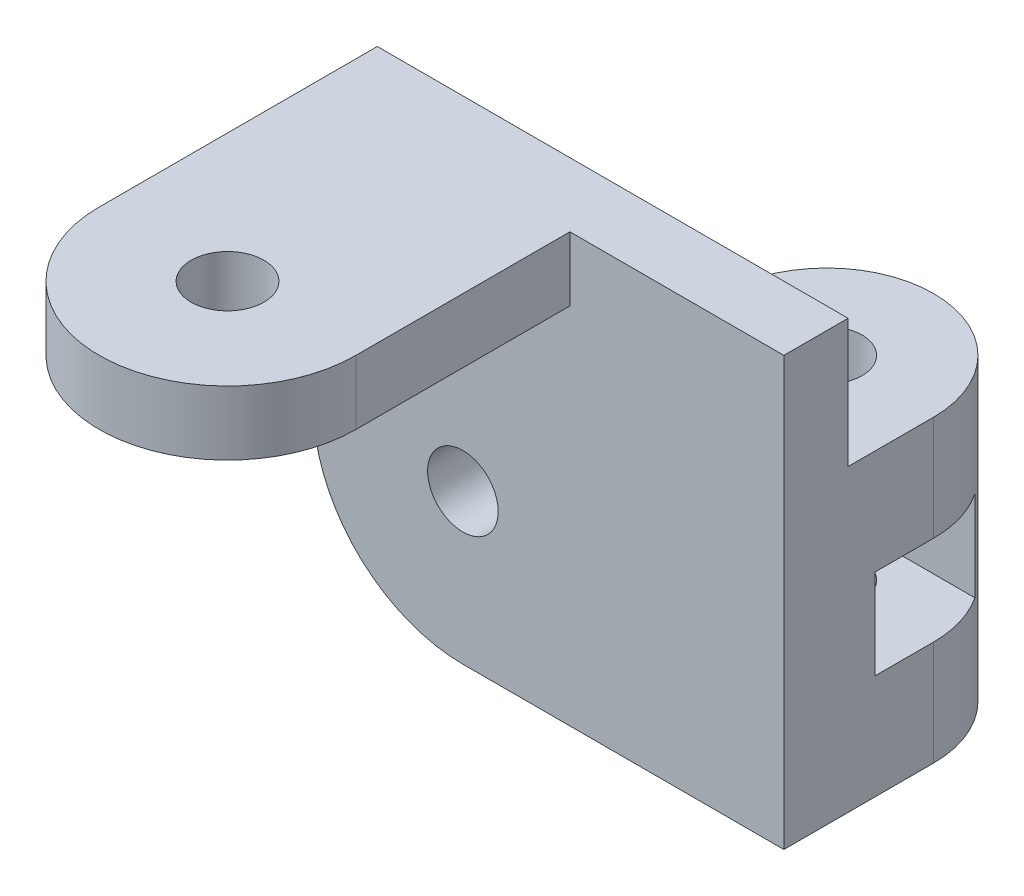
ISO-10303-21;
HEADER;
FILE_DESCRIPTION(('STEP AP214'),'2;1');
FILE_NAME('part.step','',(''),(''),'','','');
FILE_SCHEMA(('AUTOMOTIVE_DESIGN { 1 0 10303 214 1 1 1 1 }'));
ENDSEC;
DATA;
#1=APPLICATION_CONTEXT('core data for automotive mechanical design processes');
#2=APPLICATION_PROTOCOL_DEFINITION('international standard','automotive_design',2000,#1);
#3=PRODUCT_CONTEXT('',#1,'mechanical');
#4=PRODUCT('Part','Part','',(#3));
#5=PRODUCT_RELATED_PRODUCT_CATEGORY('part','',(#4));
#6=PRODUCT_DEFINITION_FORMATION('','',#4);
#7=PRODUCT_DEFINITION_CONTEXT('part definition',#1,'design');
#8=PRODUCT_DEFINITION('design','',#6,#7);
#9=PRODUCT_DEFINITION_SHAPE('','',#8);
#10=(LENGTH_UNIT() NAMED_UNIT(*) SI_UNIT(.MILLI.,.METRE.));
#11=(NAMED_UNIT(*) PLANE_ANGLE_UNIT() SI_UNIT($,.RADIAN.));
#12=(NAMED_UNIT(*) SI_UNIT($,.STERADIAN.) SOLID_ANGLE_UNIT());
#13=UNCERTAINTY_MEASURE_WITH_UNIT(LENGTH_MEASURE(1.E-05),#10,'distance_accuracy_value','');
#14=(GEOMETRIC_REPRESENTATION_CONTEXT(3) GLOBAL_UNCERTAINTY_ASSIGNED_CONTEXT((#13)) GLOBAL_UNIT_ASSIGNED_CONTEXT((#10,
#11,#12)) REPRESENTATION_CONTEXT('',''));
#15=CARTESIAN_POINT('',(0.,0.,0.));
#16=DIRECTION('',(0.,0.,1.));
#17=DIRECTION('',(1.,0.,0.));
#18=AXIS2_PLACEMENT_3D('',#15,#16,#17);
#19=CARTESIAN_POINT('',(7.5,7.,-4.));
#20=DIRECTION('',(0.,-1.,0.));
#21=DIRECTION('',(1.,0.,0.));
#22=AXIS2_PLACEMENT_3D('',#19,#20,#21);
#23=CYLINDRICAL_SURFACE('',#22,1.65);
#24=CARTESIAN_POINT('',(7.5,-2.1,-4.));
#25=DIRECTION('',(0.,-1.,0.));
#26=DIRECTION('',(0.,0.,-1.));
#27=AXIS2_PLACEMENT_3D('',#24,#25,#26);
#28=CIRCLE('',#27,1.65);
#29=CARTESIAN_POINT('',(7.5,-2.1,-5.65000000000001));
#30=VERTEX_POINT('',#29);
#31=EDGE_CURVE('E221',#30,#30,#28,.T.);
#32=ORIENTED_EDGE('',*,*,#31,.F.);
#33=EDGE_LOOP('',(#32));
#34=FACE_BOUND('',#33,.T.);
#35=CARTESIAN_POINT('',(7.5,-7.,-4.));
#36=DIRECTION('',(0.,1.,0.));
#37=DIRECTION('',(-1.,0.,0.));
#38=AXIS2_PLACEMENT_3D('',#35,#36,#37);
#39=CIRCLE('',#38,1.65);
#40=CARTESIAN_POINT('',(5.85,-7.,-4.));
#41=VERTEX_POINT('',#40);
#42=EDGE_CURVE('E226',#41,#41,#39,.T.);
#43=ORIENTED_EDGE('',*,*,#42,.F.);
#44=EDGE_LOOP('',(#43));
#45=FACE_BOUND('',#44,.T.);
#46=ADVANCED_FACE('F32',(#34,#45),#23,.F.);
#47=CARTESIAN_POINT('',(-2.5,0.,0.));
#48=DIRECTION('',(0.,0.,1.));
#49=DIRECTION('',(1.,0.,0.));
#50=AXIS2_PLACEMENT_3D('',#47,#48,#49);
#51=PLANE('',#50);
#52=DIRECTION('',(0.,-1.,0.));
#53=VECTOR('',#52,1.);
#54=CARTESIAN_POINT('',(-9.5,0.,0.));
#55=LINE('',#54,#53);
#56=CARTESIAN_POINT('',(-9.5,13.,0.));
#57=VERTEX_POINT('',#56);
#58=CARTESIAN_POINT('',(-9.5,0.,0.));
#59=VERTEX_POINT('',#58);
#60=EDGE_CURVE('E264',#57,#59,#55,.T.);
#61=ORIENTED_EDGE('',*,*,#60,.F.);
#62=DIRECTION('',(-1.,0.,0.));
#63=VECTOR('',#62,1.);
#64=CARTESIAN_POINT('',(-9.5,13.,0.));
#65=LINE('',#64,#63);
#66=CARTESIAN_POINT('',(12.5,13.,0.));
#67=VERTEX_POINT('',#66);
#68=EDGE_CURVE('E278',#67,#57,#65,.T.);
#69=ORIENTED_EDGE('',*,*,#68,.F.);
#70=DIRECTION('',(0.,1.,0.));
#71=VECTOR('',#70,1.);
#72=CARTESIAN_POINT('',(12.5,13.,0.));
#73=LINE('',#72,#71);
#74=CARTESIAN_POINT('',(12.5,7.,0.));
#75=VERTEX_POINT('',#74);
#76=EDGE_CURVE('E276',#75,#67,#73,.T.);
#77=ORIENTED_EDGE('',*,*,#76,.F.);
#78=DIRECTION('',(1.,0.,0.));
#79=VECTOR('',#78,1.);
#80=CARTESIAN_POINT('',(2.5,7.,0.));
#81=LINE('',#80,#79);
#82=CARTESIAN_POINT('',(2.5,7.,0.));
#83=VERTEX_POINT('',#82);
#84=EDGE_CURVE('E235',#83,#75,#81,.T.);
#85=ORIENTED_EDGE('',*,*,#84,.F.);
#86=DIRECTION('',(0.,-1.,0.));
#87=VECTOR('',#86,1.);
#88=CARTESIAN_POINT('',(2.5,7.,0.));
#89=LINE('',#88,#87);
#90=CARTESIAN_POINT('',(2.5,-7.,0.));
#91=VERTEX_POINT('',#90);
#92=EDGE_CURVE('E246',#83,#91,#89,.T.);
#93=ORIENTED_EDGE('',*,*,#92,.T.);
#94=DIRECTION('',(1.,0.,0.));
#95=VECTOR('',#94,1.);
#96=CARTESIAN_POINT('',(12.5,-7.,0.));
#97=LINE('',#96,#95);
#98=CARTESIAN_POINT('',(-2.5,-7.,0.));
#99=VERTEX_POINT('',#98);
#100=EDGE_CURVE('E273',#99,#91,#97,.T.);
#101=ORIENTED_EDGE('',*,*,#100,.F.);
#102=CARTESIAN_POINT('',(-2.5,0.,0.));
#103=DIRECTION('',(0.,0.,1.));
#104=DIRECTION('',(1.,0.,0.));
#105=AXIS2_PLACEMENT_3D('',#102,#103,#104);
#106=CIRCLE('',#105,7.);
#107=EDGE_CURVE('E257',#59,#99,#106,.T.);
#108=ORIENTED_EDGE('',*,*,#107,.F.);
#109=EDGE_LOOP('',(#61,#69,#77,#85,#93,#101,#108));
#110=FACE_BOUND('',#109,.T.);
#111=CARTESIAN_POINT('',(-2.5,0.,0.));
#112=DIRECTION('',(0.,0.,1.));
#113=DIRECTION('',(1.,0.,0.));
#114=AXIS2_PLACEMENT_3D('',#111,#112,#113);
#115=CIRCLE('',#114,1.65);
#116=CARTESIAN_POINT('',(-0.849999999999999,0.,0.));
#117=VERTEX_POINT('',#116);
#118=EDGE_CURVE('E253',#117,#117,#115,.T.);
#119=ORIENTED_EDGE('',*,*,#118,.T.);
#120=EDGE_LOOP('',(#119));
#121=FACE_BOUND('',#120,.T.);
#122=ADVANCED_FACE('F344',(#110,#121),#51,.F.);
#123=CARTESIAN_POINT('',(-2.5,0.,3.));
#124=DIRECTION('',(0.,0.,1.));
#125=DIRECTION('',(1.,0.,0.));
#126=AXIS2_PLACEMENT_3D('',#123,#124,#125);
#127=PLANE('',#126);
#128=DIRECTION('',(0.,1.,0.));
#129=VECTOR('',#128,1.);
#130=CARTESIAN_POINT('',(2.5,0.,3.));
#131=LINE('',#130,#129);
#132=CARTESIAN_POINT('',(2.5,10.,3.));
#133=VERTEX_POINT('',#132);
#134=CARTESIAN_POINT('',(2.5,13.,3.));
#135=VERTEX_POINT('',#134);
#136=EDGE_CURVE('E47',#133,#135,#131,.T.);
#137=ORIENTED_EDGE('',*,*,#136,.F.);
#138=DIRECTION('',(1.,0.,0.));
#139=VECTOR('',#138,1.);
#140=CARTESIAN_POINT('',(-2.5,10.,3.));
#141=LINE('',#140,#139);
#142=CARTESIAN_POINT('',(-9.5,9.99999999999999,3.));
#143=VERTEX_POINT('',#142);
#144=EDGE_CURVE('E182',#143,#133,#141,.T.);
#145=ORIENTED_EDGE('',*,*,#144,.F.);
#146=DIRECTION('',(0.,-1.,0.));
#147=VECTOR('',#146,1.);
#148=CARTESIAN_POINT('',(-9.5,0.,3.));
#149=LINE('',#148,#147);
#150=CARTESIAN_POINT('',(-9.5,0.,3.));
#151=VERTEX_POINT('',#150);
#152=EDGE_CURVE('E157',#143,#151,#149,.T.);
#153=ORIENTED_EDGE('',*,*,#152,.T.);
#154=CARTESIAN_POINT('',(-2.5,0.,3.));
#155=DIRECTION('',(0.,0.,1.));
#156=DIRECTION('',(1.,0.,0.));
#157=AXIS2_PLACEMENT_3D('',#154,#155,#156);
#158=CIRCLE('',#157,7.);
#159=CARTESIAN_POINT('',(-2.5,-7.,3.));
#160=VERTEX_POINT('',#159);
#161=EDGE_CURVE('E260',#151,#160,#158,.T.);
#162=ORIENTED_EDGE('',*,*,#161,.T.);
#163=DIRECTION('',(1.,0.,0.));
#164=VECTOR('',#163,1.);
#165=CARTESIAN_POINT('',(-2.5,-7.,3.));
#166=LINE('',#165,#164);
#167=CARTESIAN_POINT('',(12.5,-7.,3.));
#168=VERTEX_POINT('',#167);
#169=EDGE_CURVE('E263',#160,#168,#166,.T.);
#170=ORIENTED_EDGE('',*,*,#169,.T.);
#171=DIRECTION('',(0.,1.,0.));
#172=VECTOR('',#171,1.);
#173=CARTESIAN_POINT('',(12.5,13.,3.));
#174=LINE('',#173,#172);
#175=CARTESIAN_POINT('',(12.5,13.,3.));
#176=VERTEX_POINT('',#175);
#177=EDGE_CURVE('E266',#168,#176,#174,.T.);
#178=ORIENTED_EDGE('',*,*,#177,.T.);
#179=DIRECTION('',(-1.,0.,0.));
#180=VECTOR('',#179,1.);
#181=CARTESIAN_POINT('',(-9.5,13.,3.));
#182=LINE('',#181,#180);
#183=EDGE_CURVE('E52',#176,#135,#182,.T.);
#184=ORIENTED_EDGE('',*,*,#183,.T.);
#185=EDGE_LOOP('',(#137,#145,#153,#162,#170,#178,#184));
#186=FACE_BOUND('',#185,.T.);
#187=CARTESIAN_POINT('',(-2.5,0.,3.));
#188=DIRECTION('',(0.,0.,1.));
#189=DIRECTION('',(1.,0.,0.));
#190=AXIS2_PLACEMENT_3D('',#187,#188,#189);
#191=CIRCLE('',#190,1.65);
#192=CARTESIAN_POINT('',(-0.849999999999999,0.,3.));
#193=VERTEX_POINT('',#192);
#194=EDGE_CURVE('E254',#193,#193,#191,.T.);
#195=ORIENTED_EDGE('',*,*,#194,.F.);
#196=EDGE_LOOP('',(#195));
#197=FACE_BOUND('',#196,.T.);
#198=ADVANCED_FACE('F353',(#186,#197),#127,.T.);
#199=CARTESIAN_POINT('',(-2.5,0.,3.));
#200=DIRECTION('',(0.,0.,-1.));
#201=DIRECTION('',(-1.,0.,0.));
#202=AXIS2_PLACEMENT_3D('',#199,#200,#201);
#203=CYLINDRICAL_SURFACE('',#202,7.);
#204=ORIENTED_EDGE('',*,*,#107,.T.);
#205=DIRECTION('',(0.,0.,-1.));
#206=VECTOR('',#205,1.);
#207=CARTESIAN_POINT('',(-2.5,-7.,3.));
#208=LINE('',#207,#206);
#209=EDGE_CURVE('E291',#160,#99,#208,.T.);
#210=ORIENTED_EDGE('',*,*,#209,.F.);
#211=ORIENTED_EDGE('',*,*,#161,.F.);
#212=DIRECTION('',(0.,0.,-1.));
#213=VECTOR('',#212,1.);
#214=CARTESIAN_POINT('',(-9.5,0.,3.));
#215=LINE('',#214,#213);
#216=EDGE_CURVE('E270',#151,#59,#215,.T.);
#217=ORIENTED_EDGE('',*,*,#216,.T.);
#218=EDGE_LOOP('',(#204,#210,#211,#217));
#219=FACE_BOUND('',#218,.T.);
#220=ADVANCED_FACE('F34',(#219),#203,.T.);
#221=CARTESIAN_POINT('',(12.5,-7.,3.));
#222=DIRECTION('',(0.,1.,0.));
#223=DIRECTION('',(-1.,0.,0.));
#224=AXIS2_PLACEMENT_3D('',#221,#222,#223);
#225=PLANE('',#224);
#226=ORIENTED_EDGE('',*,*,#100,.T.);
#227=DIRECTION('',(0.,0.,1.));
#228=VECTOR('',#227,1.);
#229=CARTESIAN_POINT('',(2.5,-7.,-4.));
#230=LINE('',#229,#228);
#231=CARTESIAN_POINT('',(2.5,-7.,-4.));
#232=VERTEX_POINT('',#231);
#233=EDGE_CURVE('E233',#232,#91,#230,.T.);
#234=ORIENTED_EDGE('',*,*,#233,.F.);
#235=CARTESIAN_POINT('',(7.5,-7.,-4.));
#236=DIRECTION('',(0.,1.,0.));
#237=DIRECTION('',(-1.,0.,0.));
#238=AXIS2_PLACEMENT_3D('',#235,#236,#237);
#239=CIRCLE('',#238,5.);
#240=CARTESIAN_POINT('',(12.5,-7.,-4.));
#241=VERTEX_POINT('',#240);
#242=EDGE_CURVE('E225',#241,#232,#239,.T.);
#243=ORIENTED_EDGE('',*,*,#242,.F.);
#244=DIRECTION('',(0.,0.,-1.));
#245=VECTOR('',#244,1.);
#246=CARTESIAN_POINT('',(12.5,-7.,3.));
#247=LINE('',#246,#245);
#248=EDGE_CURVE('E288',#168,#241,#247,.T.);
#249=ORIENTED_EDGE('',*,*,#248,.F.);
#250=ORIENTED_EDGE('',*,*,#169,.F.);
#251=ORIENTED_EDGE('',*,*,#209,.T.);
#252=EDGE_LOOP('',(#226,#234,#243,#249,#250,#251));
#253=FACE_BOUND('',#252,.T.);
#254=ORIENTED_EDGE('',*,*,#42,.T.);
#255=EDGE_LOOP('',(#254));
#256=FACE_BOUND('',#255,.T.);
#257=ADVANCED_FACE('F323',(#253,#256),#225,.F.);
#258=CARTESIAN_POINT('',(12.5,13.,3.));
#259=DIRECTION('',(-1.,0.,0.));
#260=DIRECTION('',(0.,-1.,0.));
#261=AXIS2_PLACEMENT_3D('',#258,#259,#260);
#262=PLANE('',#261);
#263=DIRECTION('',(0.,-1.,0.));
#264=VECTOR('',#263,1.);
#265=CARTESIAN_POINT('',(12.5,7.,-4.));
#266=LINE('',#265,#264);
#267=CARTESIAN_POINT('',(12.5,-2.1,-4.));
#268=VERTEX_POINT('',#267);
#269=EDGE_CURVE('E239',#268,#241,#266,.T.);
#270=ORIENTED_EDGE('',*,*,#269,.F.);
#271=DIRECTION('',(0.,0.,-1.));
#272=VECTOR('',#271,1.);
#273=CARTESIAN_POINT('',(12.5,-2.1,-6.75));
#274=LINE('',#273,#272);
#275=CARTESIAN_POINT('',(12.5,-2.1,-1.25));
#276=VERTEX_POINT('',#275);
#277=EDGE_CURVE('E191',#276,#268,#274,.T.);
#278=ORIENTED_EDGE('',*,*,#277,.F.);
#279=DIRECTION('',(0.,-1.,0.));
#280=VECTOR('',#279,1.);
#281=CARTESIAN_POINT('',(12.5,2.1,-1.25));
#282=LINE('',#281,#280);
#283=CARTESIAN_POINT('',(12.5,2.1,-1.25));
#284=VERTEX_POINT('',#283);
#285=EDGE_CURVE('E199',#284,#276,#282,.T.);
#286=ORIENTED_EDGE('',*,*,#285,.F.);
#287=DIRECTION('',(0.,0.,1.));
#288=VECTOR('',#287,1.);
#289=CARTESIAN_POINT('',(12.5,2.1,-6.75));
#290=LINE('',#289,#288);
#291=CARTESIAN_POINT('',(12.5,2.1,-4.));
#292=VERTEX_POINT('',#291);
#293=EDGE_CURVE('E186',#292,#284,#290,.T.);
#294=ORIENTED_EDGE('',*,*,#293,.F.);
#295=CARTESIAN_POINT('',(12.5,7.,-4.));
#296=VERTEX_POINT('',#295);
#297=EDGE_CURVE('E243',#296,#292,#266,.T.);
#298=ORIENTED_EDGE('',*,*,#297,.F.);
#299=DIRECTION('',(0.,0.,-1.));
#300=VECTOR('',#299,1.);
#301=CARTESIAN_POINT('',(12.5,7.,0.));
#302=LINE('',#301,#300);
#303=EDGE_CURVE('E237',#75,#296,#302,.T.);
#304=ORIENTED_EDGE('',*,*,#303,.F.);
#305=ORIENTED_EDGE('',*,*,#76,.T.);
#306=DIRECTION('',(0.,0.,-1.));
#307=VECTOR('',#306,1.);
#308=CARTESIAN_POINT('',(12.5,13.,3.));
#309=LINE('',#308,#307);
#310=EDGE_CURVE('E285',#176,#67,#309,.T.);
#311=ORIENTED_EDGE('',*,*,#310,.F.);
#312=ORIENTED_EDGE('',*,*,#177,.F.);
#313=ORIENTED_EDGE('',*,*,#248,.T.);
#314=EDGE_LOOP('',(#270,#278,#286,#294,#298,#304,#305,#311,#312,#313));
#315=FACE_BOUND('',#314,.T.);
#316=ADVANCED_FACE('F315',(#315),#262,.F.);
#317=CARTESIAN_POINT('',(-9.5,13.,3.));
#318=DIRECTION('',(0.,-1.,0.));
#319=DIRECTION('',(0.,0.,-1.));
#320=AXIS2_PLACEMENT_3D('',#317,#318,#319);
#321=PLANE('',#320);
#322=ORIENTED_EDGE('',*,*,#68,.T.);
#323=DIRECTION('',(0.,0.,-1.));
#324=VECTOR('',#323,1.);
#325=CARTESIAN_POINT('',(-9.5,13.,3.));
#326=LINE('',#325,#324);
#327=CARTESIAN_POINT('',(-9.5,13.,13.));
#328=VERTEX_POINT('',#327);
#329=EDGE_CURVE('E283',#328,#57,#326,.T.);
#330=ORIENTED_EDGE('',*,*,#329,.F.);
#331=CARTESIAN_POINT('',(-3.5,13.,13.));
#332=DIRECTION('',(0.,1.,0.));
#333=DIRECTION('',(0.,0.,-1.));
#334=AXIS2_PLACEMENT_3D('',#331,#332,#333);
#335=CIRCLE('',#334,6.);
#336=CARTESIAN_POINT('',(2.5,13.,13.));
#337=VERTEX_POINT('',#336);
#338=EDGE_CURVE('E168',#328,#337,#335,.T.);
#339=ORIENTED_EDGE('',*,*,#338,.T.);
#340=DIRECTION('',(0.,0.,-1.));
#341=VECTOR('',#340,1.);
#342=CARTESIAN_POINT('',(2.5,13.,0.));
#343=LINE('',#342,#341);
#344=EDGE_CURVE('E161',#337,#135,#343,.T.);
#345=ORIENTED_EDGE('',*,*,#344,.T.);
#346=ORIENTED_EDGE('',*,*,#183,.F.);
#347=ORIENTED_EDGE('',*,*,#310,.T.);
#348=EDGE_LOOP('',(#322,#330,#339,#345,#346,#347));
#349=FACE_BOUND('',#348,.T.);
#350=CARTESIAN_POINT('',(-3.5,13.,13.));
#351=DIRECTION('',(0.,1.,0.));
#352=DIRECTION('',(0.,0.,1.));
#353=AXIS2_PLACEMENT_3D('',#350,#351,#352);
#354=CIRCLE('',#353,1.7);
#355=CARTESIAN_POINT('',(-3.5,13.,14.7));
#356=VERTEX_POINT('',#355);
#357=EDGE_CURVE('E548',#356,#356,#354,.T.);
#358=ORIENTED_EDGE('',*,*,#357,.F.);
#359=EDGE_LOOP('',(#358));
#360=FACE_BOUND('',#359,.T.);
#361=ADVANCED_FACE('F348',(#349,#360),#321,.F.);
#362=CARTESIAN_POINT('',(-9.5,0.,3.));
#363=DIRECTION('',(1.,0.,0.));
#364=DIRECTION('',(0.,1.,0.));
#365=AXIS2_PLACEMENT_3D('',#362,#363,#364);
#366=PLANE('',#365);
#367=ORIENTED_EDGE('',*,*,#152,.F.);
#368=DIRECTION('',(0.,0.,1.));
#369=VECTOR('',#368,1.);
#370=CARTESIAN_POINT('',(-9.5,10.,13.));
#371=LINE('',#370,#369);
#372=CARTESIAN_POINT('',(-9.5,10.,13.));
#373=VERTEX_POINT('',#372);
#374=EDGE_CURVE('E150',#143,#373,#371,.T.);
#375=ORIENTED_EDGE('',*,*,#374,.T.);
#376=DIRECTION('',(0.,1.,0.));
#377=VECTOR('',#376,1.);
#378=CARTESIAN_POINT('',(-9.5,10.,13.));
#379=LINE('',#378,#377);
#380=EDGE_CURVE('E154',#373,#328,#379,.T.);
#381=ORIENTED_EDGE('',*,*,#380,.T.);
#382=ORIENTED_EDGE('',*,*,#329,.T.);
#383=ORIENTED_EDGE('',*,*,#60,.T.);
#384=ORIENTED_EDGE('',*,*,#216,.F.);
#385=EDGE_LOOP('',(#367,#375,#381,#382,#383,#384));
#386=FACE_BOUND('',#385,.T.);
#387=ADVANCED_FACE('F152',(#386),#366,.F.);
#388=CARTESIAN_POINT('',(-2.5,0.,3.));
#389=DIRECTION('',(0.,0.,-1.));
#390=DIRECTION('',(-1.,0.,0.));
#391=AXIS2_PLACEMENT_3D('',#388,#389,#390);
#392=CYLINDRICAL_SURFACE('',#391,1.65);
#393=ORIENTED_EDGE('',*,*,#194,.T.);
#394=EDGE_LOOP('',(#393));
#395=FACE_BOUND('',#394,.T.);
#396=ORIENTED_EDGE('',*,*,#118,.F.);
#397=EDGE_LOOP('',(#396));
#398=FACE_BOUND('',#397,.T.);
#399=ADVANCED_FACE('F391',(#395,#398),#392,.F.);
#400=CARTESIAN_POINT('',(7.5,7.,-4.));
#401=DIRECTION('',(0.,1.,0.));
#402=DIRECTION('',(-1.,0.,0.));
#403=AXIS2_PLACEMENT_3D('',#400,#401,#402);
#404=PLANE('',#403);
#405=CARTESIAN_POINT('',(7.5,7.,-4.));
#406=DIRECTION('',(0.,1.,0.));
#407=DIRECTION('',(-1.,0.,0.));
#408=AXIS2_PLACEMENT_3D('',#405,#406,#407);
#409=CIRCLE('',#408,5.);
#410=CARTESIAN_POINT('',(2.5,7.,-4.));
#411=VERTEX_POINT('',#410);
#412=EDGE_CURVE('E229',#296,#411,#409,.T.);
#413=ORIENTED_EDGE('',*,*,#412,.T.);
#414=DIRECTION('',(0.,0.,1.));
#415=VECTOR('',#414,1.);
#416=CARTESIAN_POINT('',(2.5,7.,-4.));
#417=LINE('',#416,#415);
#418=EDGE_CURVE('E232',#411,#83,#417,.T.);
#419=ORIENTED_EDGE('',*,*,#418,.T.);
#420=ORIENTED_EDGE('',*,*,#84,.T.);
#421=ORIENTED_EDGE('',*,*,#303,.T.);
#422=EDGE_LOOP('',(#413,#419,#420,#421));
#423=FACE_BOUND('',#422,.T.);
#424=CARTESIAN_POINT('',(7.5,7.,-4.));
#425=DIRECTION('',(0.,1.,0.));
#426=DIRECTION('',(-1.,0.,0.));
#427=AXIS2_PLACEMENT_3D('',#424,#425,#426);
#428=CIRCLE('',#427,1.65);
#429=CARTESIAN_POINT('',(5.84999999999999,7.,-4.));
#430=VERTEX_POINT('',#429);
#431=EDGE_CURVE('E222',#430,#430,#428,.T.);
#432=ORIENTED_EDGE('',*,*,#431,.F.);
#433=EDGE_LOOP('',(#432));
#434=FACE_BOUND('',#433,.T.);
#435=ADVANCED_FACE('F337',(#423,#434),#404,.T.);
#436=CARTESIAN_POINT('',(7.5,7.,-4.));
#437=DIRECTION('',(0.,-1.,0.));
#438=DIRECTION('',(1.,0.,0.));
#439=AXIS2_PLACEMENT_3D('',#436,#437,#438);
#440=CYLINDRICAL_SURFACE('',#439,5.);
#441=DIRECTION('',(0.,-1.,0.));
#442=VECTOR('',#441,1.);
#443=CARTESIAN_POINT('',(11.6758232721225,7.,-6.75));
#444=LINE('',#443,#442);
#445=CARTESIAN_POINT('',(11.6758232721225,2.1,-6.75));
#446=VERTEX_POINT('',#445);
#447=CARTESIAN_POINT('',(11.6758232721225,-2.1,-6.75));
#448=VERTEX_POINT('',#447);
#449=EDGE_CURVE('E11',#446,#448,#444,.T.);
#450=ORIENTED_EDGE('',*,*,#449,.T.);
#451=CARTESIAN_POINT('',(7.5,-2.1,-4.));
#452=DIRECTION('',(0.,-1.,0.));
#453=DIRECTION('',(0.,0.,-1.));
#454=AXIS2_PLACEMENT_3D('',#451,#452,#453);
#455=CIRCLE('',#454,5.);
#456=EDGE_CURVE('E220',#448,#268,#455,.T.);
#457=ORIENTED_EDGE('',*,*,#456,.T.);
#458=ORIENTED_EDGE('',*,*,#269,.T.);
#459=ORIENTED_EDGE('',*,*,#242,.T.);
#460=DIRECTION('',(0.,-1.,0.));
#461=VECTOR('',#460,1.);
#462=CARTESIAN_POINT('',(2.5,7.,-4.));
#463=LINE('',#462,#461);
#464=CARTESIAN_POINT('',(2.5,-2.1,-4.));
#465=VERTEX_POINT('',#464);
#466=EDGE_CURVE('E249',#465,#232,#463,.T.);
#467=ORIENTED_EDGE('',*,*,#466,.F.);
#468=CARTESIAN_POINT('',(3.32417672787748,-2.1,-6.75));
#469=VERTEX_POINT('',#468);
#470=EDGE_CURVE('E217',#465,#469,#455,.T.);
#471=ORIENTED_EDGE('',*,*,#470,.T.);
#472=DIRECTION('',(0.,-1.,0.));
#473=VECTOR('',#472,1.);
#474=CARTESIAN_POINT('',(3.32417672787748,7.,-6.75));
#475=LINE('',#474,#473);
#476=CARTESIAN_POINT('',(3.32417672787748,2.1,-6.75));
#477=VERTEX_POINT('',#476);
#478=EDGE_CURVE('E40',#469,#477,#475,.F.);
#479=ORIENTED_EDGE('',*,*,#478,.T.);
#480=CARTESIAN_POINT('',(7.5,2.1,-4.));
#481=DIRECTION('',(0.,1.,0.));
#482=DIRECTION('',(-1.,0.,0.));
#483=AXIS2_PLACEMENT_3D('',#480,#481,#482);
#484=CIRCLE('',#483,5.);
#485=CARTESIAN_POINT('',(2.5,2.1,-4.));
#486=VERTEX_POINT('',#485);
#487=EDGE_CURVE('E213',#477,#486,#484,.T.);
#488=ORIENTED_EDGE('',*,*,#487,.T.);
#489=EDGE_CURVE('E250',#411,#486,#463,.T.);
#490=ORIENTED_EDGE('',*,*,#489,.F.);
#491=ORIENTED_EDGE('',*,*,#412,.F.);
#492=ORIENTED_EDGE('',*,*,#297,.T.);
#493=EDGE_CURVE('E216',#292,#446,#484,.T.);
#494=ORIENTED_EDGE('',*,*,#493,.T.);
#495=EDGE_LOOP('',(#450,#457,#458,#459,#467,#471,#479,#488,#490,#491,#492,#494));
#496=FACE_BOUND('',#495,.T.);
#497=ADVANCED_FACE('F299',(#496),#440,.T.);
#498=CARTESIAN_POINT('',(2.5,7.,-4.));
#499=DIRECTION('',(1.,0.,0.));
#500=DIRECTION('',(0.,1.,0.));
#501=AXIS2_PLACEMENT_3D('',#498,#499,#500);
#502=PLANE('',#501);
#503=DIRECTION('',(0.,-1.,0.));
#504=VECTOR('',#503,1.);
#505=CARTESIAN_POINT('',(2.5,2.1,-1.25));
#506=LINE('',#505,#504);
#507=CARTESIAN_POINT('',(2.5,2.1,-1.25));
#508=VERTEX_POINT('',#507);
#509=CARTESIAN_POINT('',(2.5,-2.1,-1.25));
#510=VERTEX_POINT('',#509);
#511=EDGE_CURVE('E190',#508,#510,#506,.T.);
#512=ORIENTED_EDGE('',*,*,#511,.T.);
#513=DIRECTION('',(0.,0.,-1.));
#514=VECTOR('',#513,1.);
#515=CARTESIAN_POINT('',(2.5,-2.1,-6.75));
#516=LINE('',#515,#514);
#517=EDGE_CURVE('E194',#510,#465,#516,.T.);
#518=ORIENTED_EDGE('',*,*,#517,.T.);
#519=ORIENTED_EDGE('',*,*,#466,.T.);
#520=ORIENTED_EDGE('',*,*,#233,.T.);
#521=ORIENTED_EDGE('',*,*,#92,.F.);
#522=ORIENTED_EDGE('',*,*,#418,.F.);
#523=ORIENTED_EDGE('',*,*,#489,.T.);
#524=DIRECTION('',(0.,0.,1.));
#525=VECTOR('',#524,1.);
#526=CARTESIAN_POINT('',(2.5,2.1,-6.75));
#527=LINE('',#526,#525);
#528=EDGE_CURVE('E187',#486,#508,#527,.T.);
#529=ORIENTED_EDGE('',*,*,#528,.T.);
#530=EDGE_LOOP('',(#512,#518,#519,#520,#521,#522,#523,#529));
#531=FACE_BOUND('',#530,.T.);
#532=ADVANCED_FACE('F326',(#531),#502,.F.);
#533=CARTESIAN_POINT('',(7.5,2.1,-4.));
#534=DIRECTION('',(0.,1.,0.));
#535=DIRECTION('',(-1.,0.,0.));
#536=AXIS2_PLACEMENT_3D('',#533,#534,#535);
#537=CIRCLE('',#536,1.65);
#538=CARTESIAN_POINT('',(5.85,2.1,-4.));
#539=VERTEX_POINT('',#538);
#540=EDGE_CURVE('E206',#539,#539,#537,.T.);
#541=ORIENTED_EDGE('',*,*,#540,.F.);
#542=EDGE_LOOP('',(#541));
#543=FACE_BOUND('',#542,.T.);
#544=ORIENTED_EDGE('',*,*,#431,.T.);
#545=EDGE_LOOP('',(#544));
#546=FACE_BOUND('',#545,.T.);
#547=ADVANCED_FACE('F371',(#543,#546),#23,.F.);
#548=CARTESIAN_POINT('',(2.5,2.1,-6.75));
#549=DIRECTION('',(0.,0.,-1.));
#550=DIRECTION('',(-1.,0.,0.));
#551=AXIS2_PLACEMENT_3D('',#548,#549,#550);
#552=PLANE('',#551);
#553=DIRECTION('',(1.,0.,0.));
#554=VECTOR('',#553,1.);
#555=CARTESIAN_POINT('',(2.5,2.1,-6.75));
#556=LINE('',#555,#554);
#557=EDGE_CURVE('E197',#477,#446,#556,.T.);
#558=ORIENTED_EDGE('',*,*,#557,.F.);
#559=ORIENTED_EDGE('',*,*,#478,.F.);
#560=DIRECTION('',(1.,0.,0.));
#561=VECTOR('',#560,1.);
#562=CARTESIAN_POINT('',(2.5,-2.1,-6.75));
#563=LINE('',#562,#561);
#564=EDGE_CURVE('E203',#469,#448,#563,.T.);
#565=ORIENTED_EDGE('',*,*,#564,.T.);
#566=ORIENTED_EDGE('',*,*,#449,.F.);
#567=EDGE_LOOP('',(#558,#559,#565,#566));
#568=FACE_BOUND('',#567,.T.);
#569=ADVANCED_FACE('F305',(#568),#552,.F.);
#570=CARTESIAN_POINT('',(2.5,-2.1,-6.75));
#571=DIRECTION('',(0.,-1.,0.));
#572=DIRECTION('',(0.,0.,-1.));
#573=AXIS2_PLACEMENT_3D('',#570,#571,#572);
#574=PLANE('',#573);
#575=ORIENTED_EDGE('',*,*,#31,.T.);
#576=EDGE_LOOP('',(#575));
#577=FACE_BOUND('',#576,.T.);
#578=ORIENTED_EDGE('',*,*,#564,.F.);
#579=ORIENTED_EDGE('',*,*,#470,.F.);
#580=ORIENTED_EDGE('',*,*,#517,.F.);
#581=DIRECTION('',(1.,0.,0.));
#582=VECTOR('',#581,1.);
#583=CARTESIAN_POINT('',(2.5,-2.1,-1.25));
#584=LINE('',#583,#582);
#585=EDGE_CURVE('E207',#510,#276,#584,.T.);
#586=ORIENTED_EDGE('',*,*,#585,.T.);
#587=ORIENTED_EDGE('',*,*,#277,.T.);
#588=ORIENTED_EDGE('',*,*,#456,.F.);
#589=EDGE_LOOP('',(#578,#579,#580,#586,#587,#588));
#590=FACE_BOUND('',#589,.T.);
#591=ADVANCED_FACE('F308',(#577,#590),#574,.F.);
#592=CARTESIAN_POINT('',(2.5,2.1,-6.75));
#593=DIRECTION('',(0.,1.,0.));
#594=DIRECTION('',(-1.,0.,0.));
#595=AXIS2_PLACEMENT_3D('',#592,#593,#594);
#596=PLANE('',#595);
#597=ORIENTED_EDGE('',*,*,#540,.T.);
#598=EDGE_LOOP('',(#597));
#599=FACE_BOUND('',#598,.T.);
#600=ORIENTED_EDGE('',*,*,#293,.T.);
#601=DIRECTION('',(1.,0.,0.));
#602=VECTOR('',#601,1.);
#603=CARTESIAN_POINT('',(2.5,2.1,-1.25));
#604=LINE('',#603,#602);
#605=EDGE_CURVE('E209',#508,#284,#604,.T.);
#606=ORIENTED_EDGE('',*,*,#605,.F.);
#607=ORIENTED_EDGE('',*,*,#528,.F.);
#608=ORIENTED_EDGE('',*,*,#487,.F.);
#609=ORIENTED_EDGE('',*,*,#557,.T.);
#610=ORIENTED_EDGE('',*,*,#493,.F.);
#611=EDGE_LOOP('',(#600,#606,#607,#608,#609,#610));
#612=FACE_BOUND('',#611,.T.);
#613=ADVANCED_FACE('F365',(#599,#612),#596,.F.);
#614=CARTESIAN_POINT('',(2.5,2.1,-1.25));
#615=DIRECTION('',(0.,0.,1.));
#616=DIRECTION('',(0.,-1.,0.));
#617=AXIS2_PLACEMENT_3D('',#614,#615,#616);
#618=PLANE('',#617);
#619=ORIENTED_EDGE('',*,*,#285,.T.);
#620=ORIENTED_EDGE('',*,*,#585,.F.);
#621=ORIENTED_EDGE('',*,*,#511,.F.);
#622=ORIENTED_EDGE('',*,*,#605,.T.);
#623=EDGE_LOOP('',(#619,#620,#621,#622));
#624=FACE_BOUND('',#623,.T.);
#625=ADVANCED_FACE('F329',(#624),#618,.F.);
#626=CARTESIAN_POINT('',(2.5,10.,0.));
#627=DIRECTION('',(1.,0.,0.));
#628=DIRECTION('',(0.,0.,-1.));
#629=AXIS2_PLACEMENT_3D('',#626,#627,#628);
#630=PLANE('',#629);
#631=DIRECTION('',(0.,0.,-1.));
#632=VECTOR('',#631,1.);
#633=CARTESIAN_POINT('',(2.5,10.,0.));
#634=LINE('',#633,#632);
#635=CARTESIAN_POINT('',(2.5,10.,13.));
#636=VERTEX_POINT('',#635);
#637=EDGE_CURVE('E170',#636,#133,#634,.T.);
#638=ORIENTED_EDGE('',*,*,#637,.T.);
#639=ORIENTED_EDGE('',*,*,#136,.T.);
#640=ORIENTED_EDGE('',*,*,#344,.F.);
#641=DIRECTION('',(0.,1.,0.));
#642=VECTOR('',#641,1.);
#643=CARTESIAN_POINT('',(2.5,10.,13.));
#644=LINE('',#643,#642);
#645=EDGE_CURVE('E169',#636,#337,#644,.T.);
#646=ORIENTED_EDGE('',*,*,#645,.F.);
#647=EDGE_LOOP('',(#638,#639,#640,#646));
#648=FACE_BOUND('',#647,.T.);
#649=ADVANCED_FACE('F356',(#648),#630,.T.);
#650=CARTESIAN_POINT('',(-3.5,10.,13.));
#651=DIRECTION('',(0.,1.,0.));
#652=DIRECTION('',(0.,0.,1.));
#653=AXIS2_PLACEMENT_3D('',#650,#651,#652);
#654=CYLINDRICAL_SURFACE('',#653,6.);
#655=ORIENTED_EDGE('',*,*,#338,.F.);
#656=ORIENTED_EDGE('',*,*,#380,.F.);
#657=CARTESIAN_POINT('',(-3.5,10.,13.));
#658=DIRECTION('',(0.,1.,0.));
#659=DIRECTION('',(0.,0.,-1.));
#660=AXIS2_PLACEMENT_3D('',#657,#658,#659);
#661=CIRCLE('',#660,6.);
#662=EDGE_CURVE('E160',#373,#636,#661,.T.);
#663=ORIENTED_EDGE('',*,*,#662,.T.);
#664=ORIENTED_EDGE('',*,*,#645,.T.);
#665=EDGE_LOOP('',(#655,#656,#663,#664));
#666=FACE_BOUND('',#665,.T.);
#667=ADVANCED_FACE('F165',(#666),#654,.T.);
#668=CARTESIAN_POINT('',(-3.5,10.,13.));
#669=DIRECTION('',(0.,-1.,0.));
#670=DIRECTION('',(0.,0.,-1.));
#671=AXIS2_PLACEMENT_3D('',#668,#669,#670);
#672=PLANE('',#671);
#673=CARTESIAN_POINT('',(-3.5,10.,13.));
#674=DIRECTION('',(0.,1.,0.));
#675=DIRECTION('',(0.,0.,1.));
#676=AXIS2_PLACEMENT_3D('',#673,#674,#675);
#677=CIRCLE('',#676,1.7);
#678=CARTESIAN_POINT('',(-3.5,10.,14.7));
#679=VERTEX_POINT('',#678);
#680=EDGE_CURVE('E179',#679,#679,#677,.T.);
#681=ORIENTED_EDGE('',*,*,#680,.T.);
#682=EDGE_LOOP('',(#681));
#683=FACE_BOUND('',#682,.T.);
#684=ORIENTED_EDGE('',*,*,#374,.F.);
#685=ORIENTED_EDGE('',*,*,#144,.T.);
#686=ORIENTED_EDGE('',*,*,#637,.F.);
#687=ORIENTED_EDGE('',*,*,#662,.F.);
#688=EDGE_LOOP('',(#684,#685,#686,#687));
#689=FACE_BOUND('',#688,.T.);
#690=ADVANCED_FACE('F172',(#683,#689),#672,.T.);
#691=CARTESIAN_POINT('',(-3.5,10.,13.));
#692=DIRECTION('',(0.,1.,0.));
#693=DIRECTION('',(0.,0.,1.));
#694=AXIS2_PLACEMENT_3D('',#691,#692,#693);
#695=CYLINDRICAL_SURFACE('',#694,1.7);
#696=ORIENTED_EDGE('',*,*,#680,.F.);
#697=EDGE_LOOP('',(#696));
#698=FACE_BOUND('',#697,.T.);
#699=ORIENTED_EDGE('',*,*,#357,.T.);
#700=EDGE_LOOP('',(#699));
#701=FACE_BOUND('',#700,.T.);
#702=ADVANCED_FACE('F530',(#698,#701),#695,.F.);
#703=CLOSED_SHELL('',(#46,#122,#198,#220,#257,#316,#361,#387,#399,#435,#497,#532,#547,#569,#591,
#613,#625,#649,#667,#690,#702));
#704=MANIFOLD_SOLID_BREP('B2',#703);
#705=ADVANCED_BREP_SHAPE_REPRESENTATION('',(#18,#704),#14);
#706=SHAPE_DEFINITION_REPRESENTATION(#9,#705);
ENDSEC;
END-ISO-10303-21;
